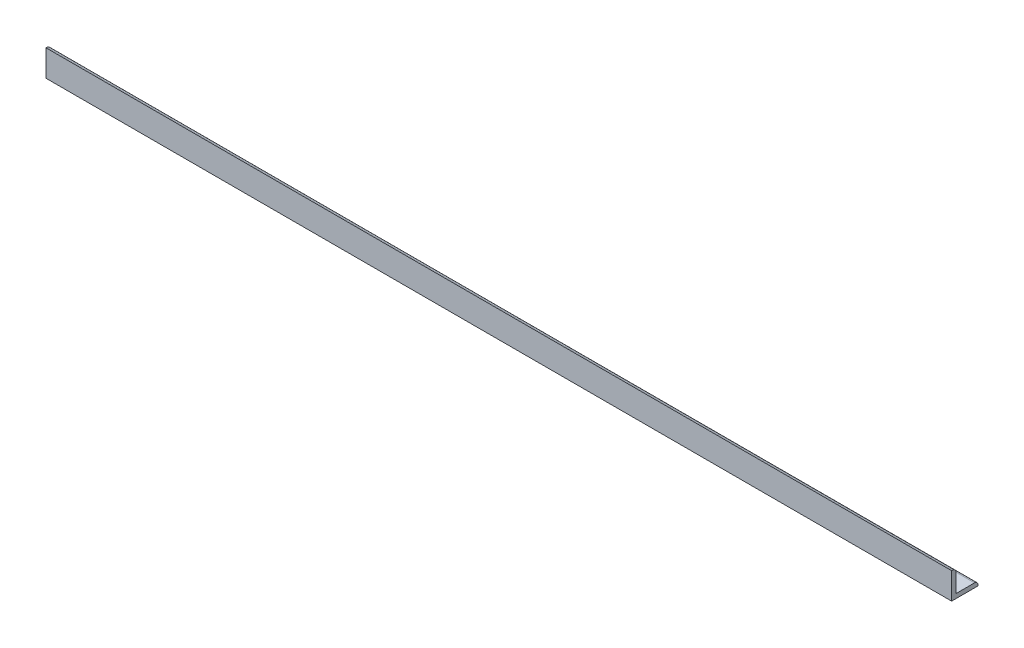
ISO-10303-21;
HEADER;
FILE_DESCRIPTION(('STEP AP214'),'2;1');
FILE_NAME('part.step','',(''),(''),'','','');
FILE_SCHEMA(('AUTOMOTIVE_DESIGN { 1 0 10303 214 1 1 1 1 }'));
ENDSEC;
DATA;
#1=APPLICATION_CONTEXT('core data for automotive mechanical design processes');
#2=APPLICATION_PROTOCOL_DEFINITION('international standard','automotive_design',2000,#1);
#3=PRODUCT_CONTEXT('',#1,'mechanical');
#4=PRODUCT('Part','Part','',(#3));
#5=PRODUCT_RELATED_PRODUCT_CATEGORY('part','',(#4));
#6=PRODUCT_DEFINITION_FORMATION('','',#4);
#7=PRODUCT_DEFINITION_CONTEXT('part definition',#1,'design');
#8=PRODUCT_DEFINITION('design','',#6,#7);
#9=PRODUCT_DEFINITION_SHAPE('','',#8);
#10=(LENGTH_UNIT() NAMED_UNIT(*) SI_UNIT(.MILLI.,.METRE.));
#11=(NAMED_UNIT(*) PLANE_ANGLE_UNIT() SI_UNIT($,.RADIAN.));
#12=(NAMED_UNIT(*) SI_UNIT($,.STERADIAN.) SOLID_ANGLE_UNIT());
#13=UNCERTAINTY_MEASURE_WITH_UNIT(LENGTH_MEASURE(1.E-05),#10,'distance_accuracy_value','');
#14=(GEOMETRIC_REPRESENTATION_CONTEXT(3) GLOBAL_UNCERTAINTY_ASSIGNED_CONTEXT((#13)) GLOBAL_UNIT_ASSIGNED_CONTEXT((#10,
#11,#12)) REPRESENTATION_CONTEXT('',''));
#15=CARTESIAN_POINT('',(0.,0.,0.));
#16=DIRECTION('',(0.,0.,1.));
#17=DIRECTION('',(1.,0.,0.));
#18=AXIS2_PLACEMENT_3D('',#15,#16,#17);
#19=CARTESIAN_POINT('',(654.07286,0.,0.));
#20=DIRECTION('',(0.,0.,-1.));
#21=DIRECTION('',(-1.,0.,0.));
#22=AXIS2_PLACEMENT_3D('',#19,#20,#21);
#23=PLANE('',#22);
#24=DIRECTION('',(0.,-1.,0.));
#25=VECTOR('',#24,1.);
#26=CARTESIAN_POINT('',(0.,0.,0.));
#27=LINE('',#26,#25);
#28=CARTESIAN_POINT('',(0.,19.05,0.));
#29=VERTEX_POINT('',#28);
#30=CARTESIAN_POINT('',(0.,0.,0.));
#31=VERTEX_POINT('',#30);
#32=EDGE_CURVE('E157',#29,#31,#27,.T.);
#33=ORIENTED_EDGE('',*,*,#32,.T.);
#34=DIRECTION('',(-1.,0.,0.));
#35=VECTOR('',#34,1.);
#36=CARTESIAN_POINT('',(654.07286,0.,0.));
#37=LINE('',#36,#35);
#38=CARTESIAN_POINT('',(654.07286,0.,0.));
#39=VERTEX_POINT('',#38);
#40=EDGE_CURVE('E11',#39,#31,#37,.T.);
#41=ORIENTED_EDGE('',*,*,#40,.F.);
#42=DIRECTION('',(0.,-1.,0.));
#43=VECTOR('',#42,1.);
#44=CARTESIAN_POINT('',(654.07286,0.,0.));
#45=LINE('',#44,#43);
#46=CARTESIAN_POINT('',(654.07286,19.05,0.));
#47=VERTEX_POINT('',#46);
#48=EDGE_CURVE('E180',#47,#39,#45,.T.);
#49=ORIENTED_EDGE('',*,*,#48,.F.);
#50=DIRECTION('',(-1.,0.,0.));
#51=VECTOR('',#50,1.);
#52=CARTESIAN_POINT('',(654.07286,19.05,0.));
#53=LINE('',#52,#51);
#54=EDGE_CURVE('E153',#47,#29,#53,.T.);
#55=ORIENTED_EDGE('',*,*,#54,.T.);
#56=EDGE_LOOP('',(#33,#41,#49,#55));
#57=FACE_BOUND('',#56,.T.);
#58=ADVANCED_FACE('F39',(#57),#23,.F.);
#59=CARTESIAN_POINT('',(654.07286,0.,0.));
#60=DIRECTION('',(0.,1.,0.));
#61=DIRECTION('',(0.,0.,1.));
#62=AXIS2_PLACEMENT_3D('',#59,#60,#61);
#63=PLANE('',#62);
#64=CARTESIAN_POINT('',(641.37286,0.,-9.84249999999998));
#65=DIRECTION('',(0.,1.,0.));
#66=DIRECTION('',(0.,0.,1.));
#67=AXIS2_PLACEMENT_3D('',#64,#65,#66);
#68=CIRCLE('',#67,2.53999999999996);
#69=CARTESIAN_POINT('',(641.37286,0.,-7.30250000000003));
#70=VERTEX_POINT('',#69);
#71=EDGE_CURVE('E162',#70,#70,#68,.F.);
#72=ORIENTED_EDGE('',*,*,#71,.F.);
#73=EDGE_LOOP('',(#72));
#74=FACE_BOUND('',#73,.T.);
#75=CARTESIAN_POINT('',(12.6999999999999,0.,-9.84249999999991));
#76=DIRECTION('',(0.,1.,0.));
#77=DIRECTION('',(0.,0.,1.));
#78=AXIS2_PLACEMENT_3D('',#75,#76,#77);
#79=CIRCLE('',#78,2.54);
#80=CARTESIAN_POINT('',(12.6999999999999,0.,-7.30249999999991));
#81=VERTEX_POINT('',#80);
#82=EDGE_CURVE('E223',#81,#81,#79,.F.);
#83=ORIENTED_EDGE('',*,*,#82,.F.);
#84=EDGE_LOOP('',(#83));
#85=FACE_BOUND('',#84,.T.);
#86=DIRECTION('',(0.,0.,-1.));
#87=VECTOR('',#86,1.);
#88=CARTESIAN_POINT('',(0.,0.,0.));
#89=LINE('',#88,#87);
#90=CARTESIAN_POINT('',(0.,0.,-19.05));
#91=VERTEX_POINT('',#90);
#92=EDGE_CURVE('E161',#31,#91,#89,.T.);
#93=ORIENTED_EDGE('',*,*,#92,.T.);
#94=DIRECTION('',(-1.,0.,0.));
#95=VECTOR('',#94,1.);
#96=CARTESIAN_POINT('',(654.07286,0.,-19.05));
#97=LINE('',#96,#95);
#98=CARTESIAN_POINT('',(654.07286,0.,-19.05));
#99=VERTEX_POINT('',#98);
#100=EDGE_CURVE('E48',#99,#91,#97,.T.);
#101=ORIENTED_EDGE('',*,*,#100,.F.);
#102=DIRECTION('',(0.,0.,-1.));
#103=VECTOR('',#102,1.);
#104=CARTESIAN_POINT('',(654.07286,0.,0.));
#105=LINE('',#104,#103);
#106=EDGE_CURVE('E113',#39,#99,#105,.T.);
#107=ORIENTED_EDGE('',*,*,#106,.F.);
#108=ORIENTED_EDGE('',*,*,#40,.T.);
#109=EDGE_LOOP('',(#93,#101,#107,#108));
#110=FACE_BOUND('',#109,.T.);
#111=ADVANCED_FACE('F253',(#74,#85,#110),#63,.F.);
#112=CARTESIAN_POINT('',(654.07286,0.,-19.05));
#113=DIRECTION('',(0.,0.,1.));
#114=DIRECTION('',(1.,0.,0.));
#115=AXIS2_PLACEMENT_3D('',#112,#113,#114);
#116=PLANE('',#115);
#117=DIRECTION('',(0.,1.,0.));
#118=VECTOR('',#117,1.);
#119=CARTESIAN_POINT('',(0.,0.,-19.05));
#120=LINE('',#119,#118);
#121=CARTESIAN_POINT('',(0.,0.634999999999981,-19.05));
#122=VERTEX_POINT('',#121);
#123=EDGE_CURVE('E165',#91,#122,#120,.T.);
#124=ORIENTED_EDGE('',*,*,#123,.T.);
#125=DIRECTION('',(-1.,0.,0.));
#126=VECTOR('',#125,1.);
#127=CARTESIAN_POINT('',(654.07286,0.634999999999981,-19.05));
#128=LINE('',#127,#126);
#129=CARTESIAN_POINT('',(654.07286,0.634999999999981,-19.05));
#130=VERTEX_POINT('',#129);
#131=EDGE_CURVE('E191',#130,#122,#128,.T.);
#132=ORIENTED_EDGE('',*,*,#131,.F.);
#133=DIRECTION('',(0.,1.,0.));
#134=VECTOR('',#133,1.);
#135=CARTESIAN_POINT('',(654.07286,0.,-19.05));
#136=LINE('',#135,#134);
#137=EDGE_CURVE('E201',#99,#130,#136,.T.);
#138=ORIENTED_EDGE('',*,*,#137,.F.);
#139=ORIENTED_EDGE('',*,*,#100,.T.);
#140=EDGE_LOOP('',(#124,#132,#138,#139));
#141=FACE_BOUND('',#140,.T.);
#142=ADVANCED_FACE('F199',(#141),#116,.F.);
#143=CARTESIAN_POINT('',(654.07286,0.635,-16.51));
#144=DIRECTION('',(-1.,0.,0.));
#145=DIRECTION('',(0.,0.,1.));
#146=AXIS2_PLACEMENT_3D('',#143,#144,#145);
#147=CYLINDRICAL_SURFACE('',#146,2.54);
#148=CARTESIAN_POINT('',(0.,0.635,-16.51));
#149=DIRECTION('',(1.,0.,0.));
#150=DIRECTION('',(0.,0.,1.));
#151=AXIS2_PLACEMENT_3D('',#148,#149,#150);
#152=CIRCLE('',#151,2.54);
#153=CARTESIAN_POINT('',(0.,3.175,-16.51));
#154=VERTEX_POINT('',#153);
#155=EDGE_CURVE('E168',#122,#154,#152,.T.);
#156=ORIENTED_EDGE('',*,*,#155,.T.);
#157=DIRECTION('',(-1.,0.,0.));
#158=VECTOR('',#157,1.);
#159=CARTESIAN_POINT('',(654.07286,3.175,-16.51));
#160=LINE('',#159,#158);
#161=CARTESIAN_POINT('',(654.07286,3.175,-16.51));
#162=VERTEX_POINT('',#161);
#163=EDGE_CURVE('E187',#162,#154,#160,.T.);
#164=ORIENTED_EDGE('',*,*,#163,.F.);
#165=CARTESIAN_POINT('',(654.07286,0.635,-16.51));
#166=DIRECTION('',(1.,0.,0.));
#167=DIRECTION('',(0.,0.,1.));
#168=AXIS2_PLACEMENT_3D('',#165,#166,#167);
#169=CIRCLE('',#168,2.54);
#170=EDGE_CURVE('E214',#130,#162,#169,.T.);
#171=ORIENTED_EDGE('',*,*,#170,.F.);
#172=ORIENTED_EDGE('',*,*,#131,.T.);
#173=EDGE_LOOP('',(#156,#164,#171,#172));
#174=FACE_BOUND('',#173,.T.);
#175=ADVANCED_FACE('F209',(#174),#147,.T.);
#176=CARTESIAN_POINT('',(654.07286,3.175,-3.175));
#177=DIRECTION('',(0.,-1.,0.));
#178=DIRECTION('',(0.,0.,-1.));
#179=AXIS2_PLACEMENT_3D('',#176,#177,#178);
#180=PLANE('',#179);
#181=CARTESIAN_POINT('',(641.37286,3.175,-9.84249999999998));
#182=DIRECTION('',(0.,1.,0.));
#183=DIRECTION('',(0.,0.,1.));
#184=AXIS2_PLACEMENT_3D('',#181,#182,#183);
#185=CIRCLE('',#184,2.53999999999996);
#186=CARTESIAN_POINT('',(641.37286,3.175,-7.30250000000003));
#187=VERTEX_POINT('',#186);
#188=EDGE_CURVE('E227',#187,#187,#185,.T.);
#189=ORIENTED_EDGE('',*,*,#188,.F.);
#190=EDGE_LOOP('',(#189));
#191=FACE_BOUND('',#190,.T.);
#192=CARTESIAN_POINT('',(12.6999999999999,3.175,-9.84249999999991));
#193=DIRECTION('',(0.,1.,0.));
#194=DIRECTION('',(0.,0.,1.));
#195=AXIS2_PLACEMENT_3D('',#192,#193,#194);
#196=CIRCLE('',#195,2.54);
#197=CARTESIAN_POINT('',(12.6999999999999,3.175,-7.30249999999991));
#198=VERTEX_POINT('',#197);
#199=EDGE_CURVE('E228',#198,#198,#196,.T.);
#200=ORIENTED_EDGE('',*,*,#199,.F.);
#201=EDGE_LOOP('',(#200));
#202=FACE_BOUND('',#201,.T.);
#203=DIRECTION('',(0.,0.,1.));
#204=VECTOR('',#203,1.);
#205=CARTESIAN_POINT('',(0.,3.175,-3.175));
#206=LINE('',#205,#204);
#207=CARTESIAN_POINT('',(0.,3.175,-3.175));
#208=VERTEX_POINT('',#207);
#209=EDGE_CURVE('E171',#154,#208,#206,.T.);
#210=ORIENTED_EDGE('',*,*,#209,.T.);
#211=DIRECTION('',(-1.,0.,0.));
#212=VECTOR('',#211,1.);
#213=CARTESIAN_POINT('',(654.07286,3.175,-3.175));
#214=LINE('',#213,#212);
#215=CARTESIAN_POINT('',(654.07286,3.175,-3.175));
#216=VERTEX_POINT('',#215);
#217=EDGE_CURVE('E145',#216,#208,#214,.T.);
#218=ORIENTED_EDGE('',*,*,#217,.F.);
#219=DIRECTION('',(0.,0.,1.));
#220=VECTOR('',#219,1.);
#221=CARTESIAN_POINT('',(654.07286,3.175,-3.175));
#222=LINE('',#221,#220);
#223=EDGE_CURVE('E134',#162,#216,#222,.T.);
#224=ORIENTED_EDGE('',*,*,#223,.F.);
#225=ORIENTED_EDGE('',*,*,#163,.T.);
#226=EDGE_LOOP('',(#210,#218,#224,#225));
#227=FACE_BOUND('',#226,.T.);
#228=ADVANCED_FACE('F212',(#191,#202,#227),#180,.F.);
#229=CARTESIAN_POINT('',(654.07286,3.175,-3.175));
#230=DIRECTION('',(0.,0.,1.));
#231=DIRECTION('',(1.,0.,0.));
#232=AXIS2_PLACEMENT_3D('',#229,#230,#231);
#233=PLANE('',#232);
#234=DIRECTION('',(0.,1.,0.));
#235=VECTOR('',#234,1.);
#236=CARTESIAN_POINT('',(0.,3.175,-3.175));
#237=LINE('',#236,#235);
#238=CARTESIAN_POINT('',(0.,16.51,-3.175));
#239=VERTEX_POINT('',#238);
#240=EDGE_CURVE('E143',#208,#239,#237,.T.);
#241=ORIENTED_EDGE('',*,*,#240,.T.);
#242=DIRECTION('',(-1.,0.,0.));
#243=VECTOR('',#242,1.);
#244=CARTESIAN_POINT('',(654.07286,16.51,-3.175));
#245=LINE('',#244,#243);
#246=CARTESIAN_POINT('',(654.07286,16.51,-3.175));
#247=VERTEX_POINT('',#246);
#248=EDGE_CURVE('E140',#247,#239,#245,.T.);
#249=ORIENTED_EDGE('',*,*,#248,.F.);
#250=DIRECTION('',(0.,1.,0.));
#251=VECTOR('',#250,1.);
#252=CARTESIAN_POINT('',(654.07286,3.175,-3.175));
#253=LINE('',#252,#251);
#254=EDGE_CURVE('E128',#216,#247,#253,.T.);
#255=ORIENTED_EDGE('',*,*,#254,.F.);
#256=ORIENTED_EDGE('',*,*,#217,.T.);
#257=EDGE_LOOP('',(#241,#249,#255,#256));
#258=FACE_BOUND('',#257,.T.);
#259=ADVANCED_FACE('F141',(#258),#233,.F.);
#260=CARTESIAN_POINT('',(654.07286,16.51,-0.635));
#261=DIRECTION('',(-1.,0.,0.));
#262=DIRECTION('',(0.,0.,1.));
#263=AXIS2_PLACEMENT_3D('',#260,#261,#262);
#264=CYLINDRICAL_SURFACE('',#263,2.54);
#265=CARTESIAN_POINT('',(0.,16.51,-0.635));
#266=DIRECTION('',(1.,0.,0.));
#267=DIRECTION('',(0.,0.,-1.));
#268=AXIS2_PLACEMENT_3D('',#265,#266,#267);
#269=CIRCLE('',#268,2.54);
#270=CARTESIAN_POINT('',(0.,19.05,-0.634999999999982));
#271=VERTEX_POINT('',#270);
#272=EDGE_CURVE('E96',#239,#271,#269,.T.);
#273=ORIENTED_EDGE('',*,*,#272,.T.);
#274=DIRECTION('',(-1.,0.,0.));
#275=VECTOR('',#274,1.);
#276=CARTESIAN_POINT('',(654.07286,19.05,-0.634999999999982));
#277=LINE('',#276,#275);
#278=CARTESIAN_POINT('',(654.07286,19.05,-0.634999999999982));
#279=VERTEX_POINT('',#278);
#280=EDGE_CURVE('E146',#279,#271,#277,.T.);
#281=ORIENTED_EDGE('',*,*,#280,.F.);
#282=CARTESIAN_POINT('',(654.07286,16.51,-0.635));
#283=DIRECTION('',(1.,0.,0.));
#284=DIRECTION('',(0.,0.,-1.));
#285=AXIS2_PLACEMENT_3D('',#282,#283,#284);
#286=CIRCLE('',#285,2.54);
#287=EDGE_CURVE('E132',#247,#279,#286,.T.);
#288=ORIENTED_EDGE('',*,*,#287,.F.);
#289=ORIENTED_EDGE('',*,*,#248,.T.);
#290=EDGE_LOOP('',(#273,#281,#288,#289));
#291=FACE_BOUND('',#290,.T.);
#292=ADVANCED_FACE('F148',(#291),#264,.T.);
#293=CARTESIAN_POINT('',(654.07286,19.05,0.));
#294=DIRECTION('',(0.,-1.,0.));
#295=DIRECTION('',(0.,0.,-1.));
#296=AXIS2_PLACEMENT_3D('',#293,#294,#295);
#297=PLANE('',#296);
#298=DIRECTION('',(0.,0.,1.));
#299=VECTOR('',#298,1.);
#300=CARTESIAN_POINT('',(0.,19.05,0.));
#301=LINE('',#300,#299);
#302=EDGE_CURVE('E102',#271,#29,#301,.T.);
#303=ORIENTED_EDGE('',*,*,#302,.T.);
#304=ORIENTED_EDGE('',*,*,#54,.F.);
#305=DIRECTION('',(0.,0.,1.));
#306=VECTOR('',#305,1.);
#307=CARTESIAN_POINT('',(654.07286,19.05,0.));
#308=LINE('',#307,#306);
#309=EDGE_CURVE('E59',#279,#47,#308,.T.);
#310=ORIENTED_EDGE('',*,*,#309,.F.);
#311=ORIENTED_EDGE('',*,*,#280,.T.);
#312=EDGE_LOOP('',(#303,#304,#310,#311));
#313=FACE_BOUND('',#312,.T.);
#314=ADVANCED_FACE('F259',(#313),#297,.F.);
#315=CARTESIAN_POINT('',(654.07286,16.51,-0.635));
#316=DIRECTION('',(1.,0.,0.));
#317=DIRECTION('',(0.,0.,-1.));
#318=AXIS2_PLACEMENT_3D('',#315,#316,#317);
#319=PLANE('',#318);
#320=ORIENTED_EDGE('',*,*,#48,.T.);
#321=ORIENTED_EDGE('',*,*,#106,.T.);
#322=ORIENTED_EDGE('',*,*,#137,.T.);
#323=ORIENTED_EDGE('',*,*,#170,.T.);
#324=ORIENTED_EDGE('',*,*,#223,.T.);
#325=ORIENTED_EDGE('',*,*,#254,.T.);
#326=ORIENTED_EDGE('',*,*,#287,.T.);
#327=ORIENTED_EDGE('',*,*,#309,.T.);
#328=EDGE_LOOP('',(#320,#321,#322,#323,#324,#325,#326,#327));
#329=FACE_BOUND('',#328,.T.);
#330=ADVANCED_FACE('F130',(#329),#319,.T.);
#331=CARTESIAN_POINT('',(0.,16.51,-0.635));
#332=DIRECTION('',(1.,0.,0.));
#333=DIRECTION('',(0.,0.,-1.));
#334=AXIS2_PLACEMENT_3D('',#331,#332,#333);
#335=PLANE('',#334);
#336=ORIENTED_EDGE('',*,*,#32,.F.);
#337=ORIENTED_EDGE('',*,*,#302,.F.);
#338=ORIENTED_EDGE('',*,*,#272,.F.);
#339=ORIENTED_EDGE('',*,*,#240,.F.);
#340=ORIENTED_EDGE('',*,*,#209,.F.);
#341=ORIENTED_EDGE('',*,*,#155,.F.);
#342=ORIENTED_EDGE('',*,*,#123,.F.);
#343=ORIENTED_EDGE('',*,*,#92,.F.);
#344=EDGE_LOOP('',(#336,#337,#338,#339,#340,#341,#342,#343));
#345=FACE_BOUND('',#344,.T.);
#346=ADVANCED_FACE('F205',(#345),#335,.F.);
#347=CARTESIAN_POINT('',(12.6999999999999,-0.00100000000000013,-9.84249999999991));
#348=DIRECTION('',(0.,1.,0.));
#349=DIRECTION('',(0.,0.,1.));
#350=AXIS2_PLACEMENT_3D('',#347,#348,#349);
#351=CYLINDRICAL_SURFACE('',#350,2.54);
#352=ORIENTED_EDGE('',*,*,#199,.T.);
#353=EDGE_LOOP('',(#352));
#354=FACE_BOUND('',#353,.T.);
#355=ORIENTED_EDGE('',*,*,#82,.T.);
#356=EDGE_LOOP('',(#355));
#357=FACE_BOUND('',#356,.T.);
#358=ADVANCED_FACE('F247',(#354,#357),#351,.F.);
#359=CARTESIAN_POINT('',(641.37286,-0.00100000000000013,-9.84249999999998));
#360=DIRECTION('',(0.,1.,0.));
#361=DIRECTION('',(0.,0.,1.));
#362=AXIS2_PLACEMENT_3D('',#359,#360,#361);
#363=CYLINDRICAL_SURFACE('',#362,2.53999999999996);
#364=ORIENTED_EDGE('',*,*,#188,.T.);
#365=EDGE_LOOP('',(#364));
#366=FACE_BOUND('',#365,.T.);
#367=ORIENTED_EDGE('',*,*,#71,.T.);
#368=EDGE_LOOP('',(#367));
#369=FACE_BOUND('',#368,.T.);
#370=ADVANCED_FACE('F239',(#366,#369),#363,.F.);
#371=CLOSED_SHELL('',(#58,#111,#142,#175,#228,#259,#292,#314,#330,#346,#358,#370));
#372=MANIFOLD_SOLID_BREP('B2',#371);
#373=ADVANCED_BREP_SHAPE_REPRESENTATION('',(#18,#372),#14);
#374=SHAPE_DEFINITION_REPRESENTATION(#9,#373);
ENDSEC;
END-ISO-10303-21;
